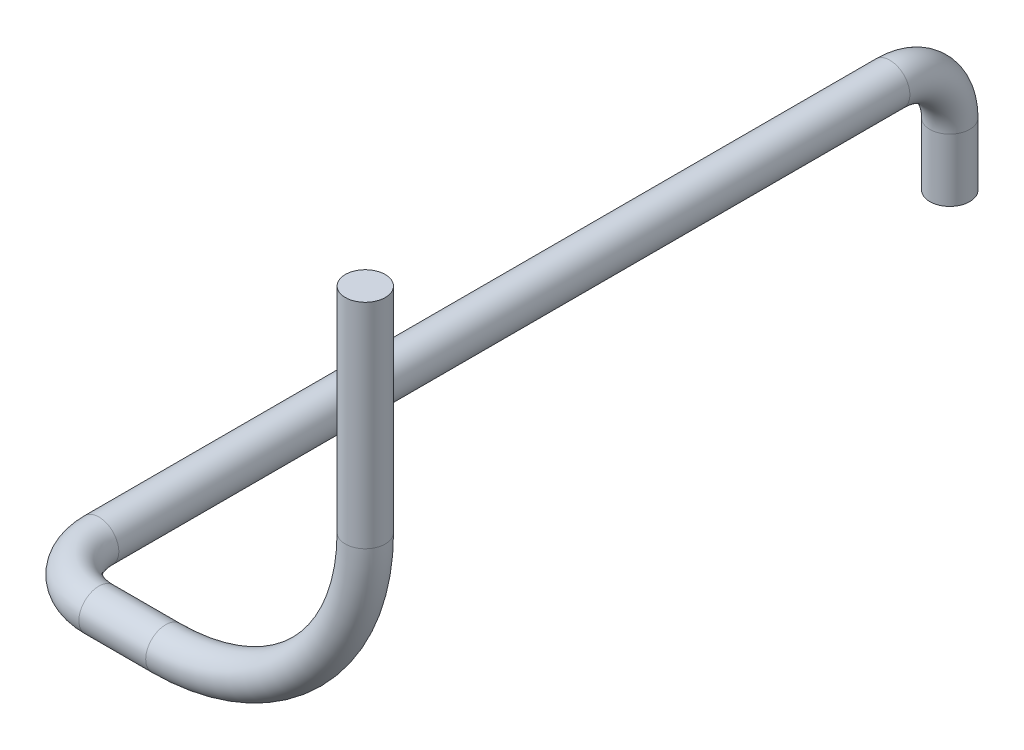
ISO-10303-21;
HEADER;
FILE_DESCRIPTION(('STEP AP214'),'2;1');
FILE_NAME('part.step','',(''),(''),'','','');
FILE_SCHEMA(('AUTOMOTIVE_DESIGN { 1 0 10303 214 1 1 1 1 }'));
ENDSEC;
DATA;
#1=APPLICATION_CONTEXT('core data for automotive mechanical design processes');
#2=APPLICATION_PROTOCOL_DEFINITION('international standard','automotive_design',2000,#1);
#3=PRODUCT_CONTEXT('',#1,'mechanical');
#4=PRODUCT('Part','Part','',(#3));
#5=PRODUCT_RELATED_PRODUCT_CATEGORY('part','',(#4));
#6=PRODUCT_DEFINITION_FORMATION('','',#4);
#7=PRODUCT_DEFINITION_CONTEXT('part definition',#1,'design');
#8=PRODUCT_DEFINITION('design','',#6,#7);
#9=PRODUCT_DEFINITION_SHAPE('','',#8);
#10=(LENGTH_UNIT() NAMED_UNIT(*) SI_UNIT(.MILLI.,.METRE.));
#11=(NAMED_UNIT(*) PLANE_ANGLE_UNIT() SI_UNIT($,.RADIAN.));
#12=(NAMED_UNIT(*) SI_UNIT($,.STERADIAN.) SOLID_ANGLE_UNIT());
#13=UNCERTAINTY_MEASURE_WITH_UNIT(LENGTH_MEASURE(1.E-05),#10,'distance_accuracy_value','');
#14=(GEOMETRIC_REPRESENTATION_CONTEXT(3) GLOBAL_UNCERTAINTY_ASSIGNED_CONTEXT((#13)) GLOBAL_UNIT_ASSIGNED_CONTEXT((#10,
#11,#12)) REPRESENTATION_CONTEXT('',''));
#15=CARTESIAN_POINT('',(0.,0.,0.));
#16=DIRECTION('',(0.,0.,1.));
#17=DIRECTION('',(1.,0.,0.));
#18=AXIS2_PLACEMENT_3D('',#15,#16,#17);
#19=CARTESIAN_POINT('',(0.,0.,0.));
#20=DIRECTION('',(0.,1.,0.));
#21=DIRECTION('',(0.,0.,1.));
#22=AXIS2_PLACEMENT_3D('',#19,#20,#21);
#23=PLANE('',#22);
#24=CARTESIAN_POINT('',(0.,0.,0.));
#25=DIRECTION('',(0.,1.,0.));
#26=DIRECTION('',(0.,0.,1.));
#27=AXIS2_PLACEMENT_3D('',#24,#25,#26);
#28=CIRCLE('',#27,1.);
#29=CARTESIAN_POINT('',(0.,0.,1.));
#30=VERTEX_POINT('',#29);
#31=EDGE_CURVE('E43',#30,#30,#28,.T.);
#32=ORIENTED_EDGE('',*,*,#31,.T.);
#33=EDGE_LOOP('',(#32));
#34=FACE_BOUND('',#33,.T.);
#35=ADVANCED_FACE('F33',(#34),#23,.T.);
#36=CARTESIAN_POINT('',(0.,0.,0.));
#37=DIRECTION('',(0.,-1.,0.));
#38=DIRECTION('',(0.,0.,-1.));
#39=AXIS2_PLACEMENT_3D('',#36,#37,#38);
#40=CYLINDRICAL_SURFACE('',#39,1.);
#41=CARTESIAN_POINT('',(0.,-10.6944840184338,0.));
#42=DIRECTION('',(0.,1.,0.));
#43=DIRECTION('',(0.,0.,1.));
#44=AXIS2_PLACEMENT_3D('',#41,#42,#43);
#45=CIRCLE('',#44,1.);
#46=CARTESIAN_POINT('',(0.999999999999999,-10.6944840184338,0.));
#47=VERTEX_POINT('',#46);
#48=EDGE_CURVE('E39',#47,#47,#45,.T.);
#49=ORIENTED_EDGE('',*,*,#48,.T.);
#50=EDGE_LOOP('',(#49));
#51=FACE_BOUND('',#50,.T.);
#52=ORIENTED_EDGE('',*,*,#31,.F.);
#53=EDGE_LOOP('',(#52));
#54=FACE_BOUND('',#53,.T.);
#55=ADVANCED_FACE('F87',(#51,#54),#40,.T.);
#56=CARTESIAN_POINT('',(-10.,-10.6944840184338,0.));
#57=DIRECTION('',(0.,0.,-1.));
#58=DIRECTION('',(-1.,0.,0.));
#59=AXIS2_PLACEMENT_3D('',#56,#57,#58);
#60=TOROIDAL_SURFACE('',#59,10.,1.);
#61=CARTESIAN_POINT('',(-10.,-20.6944840184338,0.));
#62=DIRECTION('',(1.,0.,0.));
#63=DIRECTION('',(0.,0.,1.));
#64=AXIS2_PLACEMENT_3D('',#61,#62,#63);
#65=CIRCLE('',#64,1.);
#66=CARTESIAN_POINT('',(-10.,-21.6944840184338,0.));
#67=VERTEX_POINT('',#66);
#68=EDGE_CURVE('E10',#67,#67,#65,.T.);
#69=CARTESIAN_POINT('',(-10.,-10.6944840184338,0.));
#70=DIRECTION('',(0.,0.,-1.));
#71=DIRECTION('',(-1.,0.,0.));
#72=AXIS2_PLACEMENT_3D('',#69,#70,#71);
#73=CIRCLE('',#72,11.);
#74=EDGE_CURVE('',#47,#67,#73,.T.);
#75=ORIENTED_EDGE('',*,*,#48,.F.);
#76=ORIENTED_EDGE('',*,*,#68,.T.);
#77=ORIENTED_EDGE('',*,*,#74,.T.);
#78=ORIENTED_EDGE('',*,*,#74,.F.);
#79=EDGE_LOOP('',(#75,#77,#76,#78));
#80=FACE_BOUND('',#79,.T.);
#81=ADVANCED_FACE('F90',(#80),#60,.T.);
#82=CARTESIAN_POINT('',(-10.,-20.6944840184338,0.));
#83=DIRECTION('',(-1.,0.,0.));
#84=DIRECTION('',(0.,0.,1.));
#85=AXIS2_PLACEMENT_3D('',#82,#83,#84);
#86=CYLINDRICAL_SURFACE('',#85,1.);
#87=ORIENTED_EDGE('',*,*,#68,.F.);
#88=EDGE_LOOP('',(#87));
#89=FACE_BOUND('',#88,.T.);
#90=CARTESIAN_POINT('',(-13.348220682854,-20.6944840184338,0.));
#91=DIRECTION('',(-1.,0.,0.));
#92=DIRECTION('',(0.,0.,1.));
#93=AXIS2_PLACEMENT_3D('',#90,#91,#92);
#94=CIRCLE('',#93,1.);
#95=CARTESIAN_POINT('',(-13.348220682854,-20.6944840184338,1.));
#96=VERTEX_POINT('',#95);
#97=EDGE_CURVE('E52',#96,#96,#94,.T.);
#98=ORIENTED_EDGE('',*,*,#97,.F.);
#99=EDGE_LOOP('',(#98));
#100=FACE_BOUND('',#99,.T.);
#101=ADVANCED_FACE('F81',(#89,#100),#86,.T.);
#102=CARTESIAN_POINT('',(-13.348220682854,-20.6944840184338,-3.));
#103=DIRECTION('',(0.,-1.,0.));
#104=DIRECTION('',(0.,0.,-1.));
#105=AXIS2_PLACEMENT_3D('',#102,#103,#104);
#106=TOROIDAL_SURFACE('',#105,3.,1.);
#107=CARTESIAN_POINT('',(-16.348220682854,-20.6944840184338,-3.));
#108=DIRECTION('',(0.,0.,-1.));
#109=DIRECTION('',(-1.,0.,0.));
#110=AXIS2_PLACEMENT_3D('',#107,#108,#109);
#111=CIRCLE('',#110,1.);
#112=CARTESIAN_POINT('',(-17.348220682854,-20.6944840184338,-3.));
#113=VERTEX_POINT('',#112);
#114=EDGE_CURVE('E47',#113,#113,#111,.T.);
#115=CARTESIAN_POINT('',(-13.348220682854,-20.6944840184338,-3.));
#116=DIRECTION('',(0.,-1.,0.));
#117=DIRECTION('',(0.,0.,-1.));
#118=AXIS2_PLACEMENT_3D('',#115,#116,#117);
#119=CIRCLE('',#118,4.);
#120=EDGE_CURVE('',#96,#113,#119,.T.);
#121=ORIENTED_EDGE('',*,*,#97,.T.);
#122=ORIENTED_EDGE('',*,*,#114,.F.);
#123=ORIENTED_EDGE('',*,*,#120,.T.);
#124=ORIENTED_EDGE('',*,*,#120,.F.);
#125=EDGE_LOOP('',(#121,#123,#122,#124));
#126=FACE_BOUND('',#125,.T.);
#127=ADVANCED_FACE('F72',(#126),#106,.T.);
#128=CARTESIAN_POINT('',(-16.348220682854,-20.6944840184338,-3.));
#129=DIRECTION('',(0.,0.,-1.));
#130=DIRECTION('',(-1.,0.,0.));
#131=AXIS2_PLACEMENT_3D('',#128,#129,#130);
#132=CYLINDRICAL_SURFACE('',#131,1.);
#133=ORIENTED_EDGE('',*,*,#114,.T.);
#134=EDGE_LOOP('',(#133));
#135=FACE_BOUND('',#134,.T.);
#136=CARTESIAN_POINT('',(-16.3482206828539,-20.6944840184338,-42.6295088973185));
#137=DIRECTION('',(0.,0.,-1.));
#138=DIRECTION('',(-1.,0.,0.));
#139=AXIS2_PLACEMENT_3D('',#136,#137,#138);
#140=CIRCLE('',#139,1.);
#141=CARTESIAN_POINT('',(-16.3482206828539,-19.6944840184338,-42.6295088973185));
#142=VERTEX_POINT('',#141);
#143=EDGE_CURVE('E63',#142,#142,#140,.T.);
#144=ORIENTED_EDGE('',*,*,#143,.F.);
#145=EDGE_LOOP('',(#144));
#146=FACE_BOUND('',#145,.T.);
#147=ADVANCED_FACE('F69',(#135,#146),#132,.T.);
#148=CARTESIAN_POINT('',(-16.3482206828539,-26.8313141556932,-45.6295088973185));
#149=DIRECTION('',(0.,-1.,0.));
#150=DIRECTION('',(-1.,0.,0.));
#151=AXIS2_PLACEMENT_3D('',#148,#149,#150);
#152=PLANE('',#151);
#153=CARTESIAN_POINT('',(-16.3482206828539,-26.8313141556932,-45.6295088973185));
#154=DIRECTION('',(0.,-1.,0.));
#155=DIRECTION('',(-1.,0.,0.));
#156=AXIS2_PLACEMENT_3D('',#153,#154,#155);
#157=CIRCLE('',#156,1.);
#158=CARTESIAN_POINT('',(-17.348220682854,-26.8313141556932,-45.6295088973185));
#159=VERTEX_POINT('',#158);
#160=EDGE_CURVE('E55',#159,#159,#157,.T.);
#161=ORIENTED_EDGE('',*,*,#160,.T.);
#162=EDGE_LOOP('',(#161));
#163=FACE_BOUND('',#162,.T.);
#164=ADVANCED_FACE('F71',(#163),#152,.T.);
#165=CARTESIAN_POINT('',(-16.3482206828539,-23.6944840184338,-42.6295088973185));
#166=DIRECTION('',(-1.,0.,0.));
#167=DIRECTION('',(0.,0.,1.));
#168=AXIS2_PLACEMENT_3D('',#165,#166,#167);
#169=TOROIDAL_SURFACE('',#168,3.,1.);
#170=CARTESIAN_POINT('',(-16.3482206828539,-23.6944840184338,-45.6295088973185));
#171=DIRECTION('',(0.,-1.,0.));
#172=DIRECTION('',(-1.,0.,0.));
#173=AXIS2_PLACEMENT_3D('',#170,#171,#172);
#174=CIRCLE('',#173,1.);
#175=CARTESIAN_POINT('',(-16.3482206828539,-23.6944840184338,-46.6295088973185));
#176=VERTEX_POINT('',#175);
#177=EDGE_CURVE('E59',#176,#176,#174,.T.);
#178=CARTESIAN_POINT('',(-16.3482206828539,-23.6944840184338,-42.6295088973185));
#179=DIRECTION('',(-1.,0.,0.));
#180=DIRECTION('',(0.,0.,1.));
#181=AXIS2_PLACEMENT_3D('',#178,#179,#180);
#182=CIRCLE('',#181,4.);
#183=EDGE_CURVE('',#142,#176,#182,.T.);
#184=ORIENTED_EDGE('',*,*,#143,.T.);
#185=ORIENTED_EDGE('',*,*,#177,.F.);
#186=ORIENTED_EDGE('',*,*,#183,.T.);
#187=ORIENTED_EDGE('',*,*,#183,.F.);
#188=EDGE_LOOP('',(#184,#186,#185,#187));
#189=FACE_BOUND('',#188,.T.);
#190=ADVANCED_FACE('F67',(#189),#169,.T.);
#191=CARTESIAN_POINT('',(-16.3482206828539,-23.6944840184338,-45.6295088973185));
#192=DIRECTION('',(0.,-1.,0.));
#193=DIRECTION('',(0.,0.,-1.));
#194=AXIS2_PLACEMENT_3D('',#191,#192,#193);
#195=CYLINDRICAL_SURFACE('',#194,1.);
#196=ORIENTED_EDGE('',*,*,#160,.F.);
#197=EDGE_LOOP('',(#196));
#198=FACE_BOUND('',#197,.T.);
#199=ORIENTED_EDGE('',*,*,#177,.T.);
#200=EDGE_LOOP('',(#199));
#201=FACE_BOUND('',#200,.T.);
#202=ADVANCED_FACE('F84',(#198,#201),#195,.T.);
#203=CLOSED_SHELL('',(#35,#55,#81,#101,#127,#147,#164,#190,#202));
#204=MANIFOLD_SOLID_BREP('B2',#203);
#205=ADVANCED_BREP_SHAPE_REPRESENTATION('',(#18,#204),#14);
#206=SHAPE_DEFINITION_REPRESENTATION(#9,#205);
ENDSEC;
END-ISO-10303-21;
